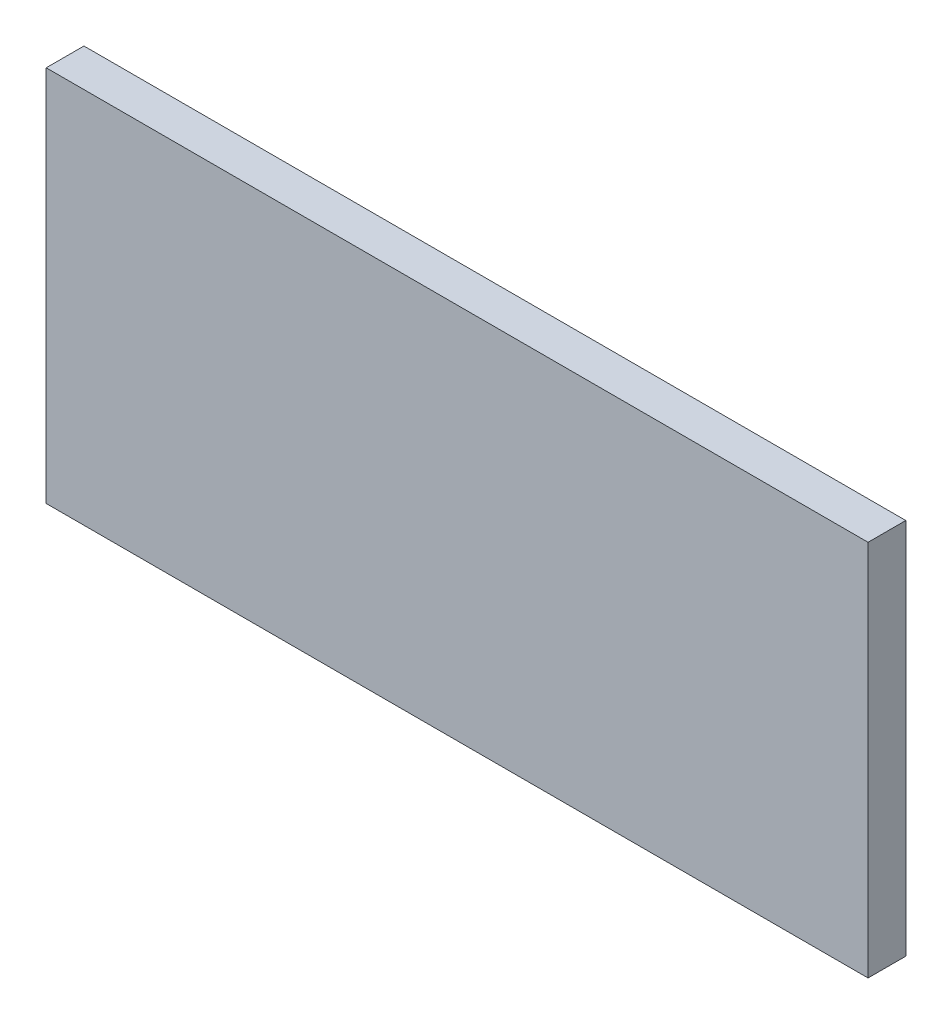
ISO-10303-21;
HEADER;
FILE_DESCRIPTION(('STEP AP214'),'2;1');
FILE_NAME('part.step','',(''),(''),'','','');
FILE_SCHEMA(('AUTOMOTIVE_DESIGN { 1 0 10303 214 1 1 1 1 }'));
ENDSEC;
DATA;
#1=APPLICATION_CONTEXT('core data for automotive mechanical design processes');
#2=APPLICATION_PROTOCOL_DEFINITION('international standard','automotive_design',2000,#1);
#3=PRODUCT_CONTEXT('',#1,'mechanical');
#4=PRODUCT('Part','Part','',(#3));
#5=PRODUCT_RELATED_PRODUCT_CATEGORY('part','',(#4));
#6=PRODUCT_DEFINITION_FORMATION('','',#4);
#7=PRODUCT_DEFINITION_CONTEXT('part definition',#1,'design');
#8=PRODUCT_DEFINITION('design','',#6,#7);
#9=PRODUCT_DEFINITION_SHAPE('','',#8);
#10=(LENGTH_UNIT() NAMED_UNIT(*) SI_UNIT(.MILLI.,.METRE.));
#11=(NAMED_UNIT(*) PLANE_ANGLE_UNIT() SI_UNIT($,.RADIAN.));
#12=(NAMED_UNIT(*) SI_UNIT($,.STERADIAN.) SOLID_ANGLE_UNIT());
#13=UNCERTAINTY_MEASURE_WITH_UNIT(LENGTH_MEASURE(1.E-05),#10,'distance_accuracy_value','');
#14=(GEOMETRIC_REPRESENTATION_CONTEXT(3) GLOBAL_UNCERTAINTY_ASSIGNED_CONTEXT((#13)) GLOBAL_UNIT_ASSIGNED_CONTEXT((#10,
#11,#12)) REPRESENTATION_CONTEXT('',''));
#15=CARTESIAN_POINT('',(0.,0.,0.));
#16=DIRECTION('',(0.,0.,1.));
#17=DIRECTION('',(1.,0.,0.));
#18=AXIS2_PLACEMENT_3D('',#15,#16,#17);
#19=CARTESIAN_POINT('',(-177.5,-81.5,16.3));
#20=DIRECTION('',(0.,1.,0.));
#21=DIRECTION('',(-1.,0.,0.));
#22=AXIS2_PLACEMENT_3D('',#19,#20,#21);
#23=PLANE('',#22);
#24=DIRECTION('',(1.,0.,0.));
#25=VECTOR('',#24,1.);
#26=CARTESIAN_POINT('',(-177.5,-81.5,0.));
#27=LINE('',#26,#25);
#28=CARTESIAN_POINT('',(-177.5,-81.5,0.));
#29=VERTEX_POINT('',#28);
#30=CARTESIAN_POINT('',(177.5,-81.5,0.));
#31=VERTEX_POINT('',#30);
#32=EDGE_CURVE('E102',#29,#31,#27,.T.);
#33=ORIENTED_EDGE('',*,*,#32,.T.);
#34=DIRECTION('',(0.,0.,-1.));
#35=VECTOR('',#34,1.);
#36=CARTESIAN_POINT('',(177.5,-81.5,16.3));
#37=LINE('',#36,#35);
#38=CARTESIAN_POINT('',(177.5,-81.5,16.3));
#39=VERTEX_POINT('',#38);
#40=EDGE_CURVE('E11',#39,#31,#37,.T.);
#41=ORIENTED_EDGE('',*,*,#40,.F.);
#42=DIRECTION('',(1.,0.,0.));
#43=VECTOR('',#42,1.);
#44=CARTESIAN_POINT('',(-177.5,-81.5,16.3));
#45=LINE('',#44,#43);
#46=CARTESIAN_POINT('',(-177.5,-81.5,16.3));
#47=VERTEX_POINT('',#46);
#48=EDGE_CURVE('E90',#47,#39,#45,.T.);
#49=ORIENTED_EDGE('',*,*,#48,.F.);
#50=DIRECTION('',(0.,0.,-1.));
#51=VECTOR('',#50,1.);
#52=CARTESIAN_POINT('',(-177.5,-81.5,16.3));
#53=LINE('',#52,#51);
#54=EDGE_CURVE('E98',#47,#29,#53,.T.);
#55=ORIENTED_EDGE('',*,*,#54,.T.);
#56=EDGE_LOOP('',(#33,#41,#49,#55));
#57=FACE_BOUND('',#56,.T.);
#58=ADVANCED_FACE('F39',(#57),#23,.F.);
#59=CARTESIAN_POINT('',(177.5,-81.5,16.3));
#60=DIRECTION('',(-1.,0.,0.));
#61=DIRECTION('',(0.,0.,1.));
#62=AXIS2_PLACEMENT_3D('',#59,#60,#61);
#63=PLANE('',#62);
#64=DIRECTION('',(0.,1.,0.));
#65=VECTOR('',#64,1.);
#66=CARTESIAN_POINT('',(177.5,-81.5,0.));
#67=LINE('',#66,#65);
#68=CARTESIAN_POINT('',(177.5,81.5,0.));
#69=VERTEX_POINT('',#68);
#70=EDGE_CURVE('E94',#31,#69,#67,.T.);
#71=ORIENTED_EDGE('',*,*,#70,.T.);
#72=DIRECTION('',(0.,0.,-1.));
#73=VECTOR('',#72,1.);
#74=CARTESIAN_POINT('',(177.5,81.5,16.3));
#75=LINE('',#74,#73);
#76=CARTESIAN_POINT('',(177.5,81.5,16.3));
#77=VERTEX_POINT('',#76);
#78=EDGE_CURVE('E47',#77,#69,#75,.T.);
#79=ORIENTED_EDGE('',*,*,#78,.F.);
#80=DIRECTION('',(0.,1.,0.));
#81=VECTOR('',#80,1.);
#82=CARTESIAN_POINT('',(177.5,-81.5,16.3));
#83=LINE('',#82,#81);
#84=EDGE_CURVE('E85',#39,#77,#83,.T.);
#85=ORIENTED_EDGE('',*,*,#84,.F.);
#86=ORIENTED_EDGE('',*,*,#40,.T.);
#87=EDGE_LOOP('',(#71,#79,#85,#86));
#88=FACE_BOUND('',#87,.T.);
#89=ADVANCED_FACE('F93',(#88),#63,.F.);
#90=CARTESIAN_POINT('',(-177.5,81.5,16.3));
#91=DIRECTION('',(0.,-1.,0.));
#92=DIRECTION('',(1.,0.,0.));
#93=AXIS2_PLACEMENT_3D('',#90,#91,#92);
#94=PLANE('',#93);
#95=DIRECTION('',(-1.,0.,0.));
#96=VECTOR('',#95,1.);
#97=CARTESIAN_POINT('',(-177.5,81.5,0.));
#98=LINE('',#97,#96);
#99=CARTESIAN_POINT('',(-177.5,81.5,0.));
#100=VERTEX_POINT('',#99);
#101=EDGE_CURVE('E72',#69,#100,#98,.T.);
#102=ORIENTED_EDGE('',*,*,#101,.T.);
#103=DIRECTION('',(0.,0.,-1.));
#104=VECTOR('',#103,1.);
#105=CARTESIAN_POINT('',(-177.5,81.5,16.3));
#106=LINE('',#105,#104);
#107=CARTESIAN_POINT('',(-177.5,81.5,16.3));
#108=VERTEX_POINT('',#107);
#109=EDGE_CURVE('E95',#108,#100,#106,.T.);
#110=ORIENTED_EDGE('',*,*,#109,.F.);
#111=DIRECTION('',(-1.,0.,0.));
#112=VECTOR('',#111,1.);
#113=CARTESIAN_POINT('',(-177.5,81.5,16.3));
#114=LINE('',#113,#112);
#115=EDGE_CURVE('E88',#77,#108,#114,.T.);
#116=ORIENTED_EDGE('',*,*,#115,.F.);
#117=ORIENTED_EDGE('',*,*,#78,.T.);
#118=EDGE_LOOP('',(#102,#110,#116,#117));
#119=FACE_BOUND('',#118,.T.);
#120=ADVANCED_FACE('F96',(#119),#94,.F.);
#121=CARTESIAN_POINT('',(-177.5,-81.5,16.3));
#122=DIRECTION('',(1.,0.,0.));
#123=DIRECTION('',(0.,0.,-1.));
#124=AXIS2_PLACEMENT_3D('',#121,#122,#123);
#125=PLANE('',#124);
#126=DIRECTION('',(0.,-1.,0.));
#127=VECTOR('',#126,1.);
#128=CARTESIAN_POINT('',(-177.5,-81.5,0.));
#129=LINE('',#128,#127);
#130=EDGE_CURVE('E78',#100,#29,#129,.T.);
#131=ORIENTED_EDGE('',*,*,#130,.T.);
#132=ORIENTED_EDGE('',*,*,#54,.F.);
#133=DIRECTION('',(0.,-1.,0.));
#134=VECTOR('',#133,1.);
#135=CARTESIAN_POINT('',(-177.5,-81.5,16.3));
#136=LINE('',#135,#134);
#137=EDGE_CURVE('E55',#108,#47,#136,.T.);
#138=ORIENTED_EDGE('',*,*,#137,.F.);
#139=ORIENTED_EDGE('',*,*,#109,.T.);
#140=EDGE_LOOP('',(#131,#132,#138,#139));
#141=FACE_BOUND('',#140,.T.);
#142=ADVANCED_FACE('F109',(#141),#125,.F.);
#143=CARTESIAN_POINT('',(0.,0.,16.3));
#144=DIRECTION('',(0.,0.,1.));
#145=DIRECTION('',(1.,0.,0.));
#146=AXIS2_PLACEMENT_3D('',#143,#144,#145);
#147=PLANE('',#146);
#148=ORIENTED_EDGE('',*,*,#48,.T.);
#149=ORIENTED_EDGE('',*,*,#84,.T.);
#150=ORIENTED_EDGE('',*,*,#115,.T.);
#151=ORIENTED_EDGE('',*,*,#137,.T.);
#152=EDGE_LOOP('',(#148,#149,#150,#151));
#153=FACE_BOUND('',#152,.T.);
#154=ADVANCED_FACE('F86',(#153),#147,.T.);
#155=CARTESIAN_POINT('',(0.,0.,0.));
#156=DIRECTION('',(0.,0.,1.));
#157=DIRECTION('',(1.,0.,0.));
#158=AXIS2_PLACEMENT_3D('',#155,#156,#157);
#159=PLANE('',#158);
#160=ORIENTED_EDGE('',*,*,#32,.F.);
#161=ORIENTED_EDGE('',*,*,#130,.F.);
#162=ORIENTED_EDGE('',*,*,#101,.F.);
#163=ORIENTED_EDGE('',*,*,#70,.F.);
#164=EDGE_LOOP('',(#160,#161,#162,#163));
#165=FACE_BOUND('',#164,.T.);
#166=ADVANCED_FACE('F112',(#165),#159,.F.);
#167=CLOSED_SHELL('',(#58,#89,#120,#142,#154,#166));
#168=MANIFOLD_SOLID_BREP('B2',#167);
#169=ADVANCED_BREP_SHAPE_REPRESENTATION('',(#18,#168),#14);
#170=SHAPE_DEFINITION_REPRESENTATION(#9,#169);
ENDSEC;
END-ISO-10303-21;
